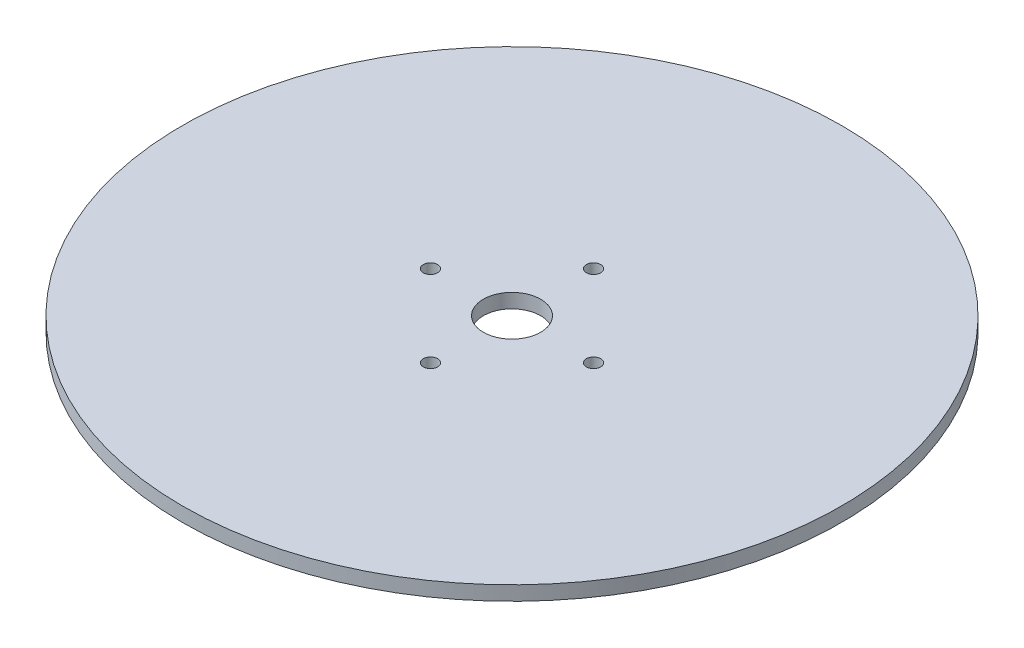
ISO-10303-21;
HEADER;
FILE_DESCRIPTION(('STEP AP214'),'2;1');
FILE_NAME('part.step','',(''),(''),'','','');
FILE_SCHEMA(('AUTOMOTIVE_DESIGN { 1 0 10303 214 1 1 1 1 }'));
ENDSEC;
DATA;
#1=APPLICATION_CONTEXT('core data for automotive mechanical design processes');
#2=APPLICATION_PROTOCOL_DEFINITION('international standard','automotive_design',2000,#1);
#3=PRODUCT_CONTEXT('',#1,'mechanical');
#4=PRODUCT('Part','Part','',(#3));
#5=PRODUCT_RELATED_PRODUCT_CATEGORY('part','',(#4));
#6=PRODUCT_DEFINITION_FORMATION('','',#4);
#7=PRODUCT_DEFINITION_CONTEXT('part definition',#1,'design');
#8=PRODUCT_DEFINITION('design','',#6,#7);
#9=PRODUCT_DEFINITION_SHAPE('','',#8);
#10=(LENGTH_UNIT() NAMED_UNIT(*) SI_UNIT(.MILLI.,.METRE.));
#11=(NAMED_UNIT(*) PLANE_ANGLE_UNIT() SI_UNIT($,.RADIAN.));
#12=(NAMED_UNIT(*) SI_UNIT($,.STERADIAN.) SOLID_ANGLE_UNIT());
#13=UNCERTAINTY_MEASURE_WITH_UNIT(LENGTH_MEASURE(1.E-05),#10,'distance_accuracy_value','');
#14=(GEOMETRIC_REPRESENTATION_CONTEXT(3) GLOBAL_UNCERTAINTY_ASSIGNED_CONTEXT((#13)) GLOBAL_UNIT_ASSIGNED_CONTEXT((#10,
#11,#12)) REPRESENTATION_CONTEXT('',''));
#15=CARTESIAN_POINT('',(0.,0.,0.));
#16=DIRECTION('',(0.,0.,1.));
#17=DIRECTION('',(1.,0.,0.));
#18=AXIS2_PLACEMENT_3D('',#15,#16,#17);
#19=CARTESIAN_POINT('',(0.,6.35,0.));
#20=DIRECTION('',(0.,1.,0.));
#21=DIRECTION('',(0.,0.,1.));
#22=AXIS2_PLACEMENT_3D('',#19,#20,#21);
#23=PLANE('',#22);
#24=CARTESIAN_POINT('',(2.04854579480274E-12,6.35,36.1315));
#25=DIRECTION('',(0.,1.,0.));
#26=DIRECTION('',(0.,0.,1.));
#27=AXIS2_PLACEMENT_3D('',#24,#25,#26);
#28=CIRCLE('',#27,3.1750000000022);
#29=CARTESIAN_POINT('',(2.04854579480274E-12,6.35,39.3065000000022));
#30=VERTEX_POINT('',#29);
#31=EDGE_CURVE('E58',#30,#30,#28,.T.);
#32=ORIENTED_EDGE('',*,*,#31,.F.);
#33=EDGE_LOOP('',(#32));
#34=FACE_BOUND('',#33,.T.);
#35=CARTESIAN_POINT('',(0.,6.35,-36.1315));
#36=DIRECTION('',(0.,1.,0.));
#37=DIRECTION('',(0.,0.,1.));
#38=AXIS2_PLACEMENT_3D('',#35,#36,#37);
#39=CIRCLE('',#38,3.175);
#40=CARTESIAN_POINT('',(0.,6.35,-32.9565));
#41=VERTEX_POINT('',#40);
#42=EDGE_CURVE('E46',#41,#41,#39,.T.);
#43=ORIENTED_EDGE('',*,*,#42,.F.);
#44=EDGE_LOOP('',(#43));
#45=FACE_BOUND('',#44,.T.);
#46=CARTESIAN_POINT('',(0.,6.35,0.));
#47=DIRECTION('',(0.,1.,0.));
#48=DIRECTION('',(0.,0.,1.));
#49=AXIS2_PLACEMENT_3D('',#46,#47,#48);
#50=CIRCLE('',#49,146.05);
#51=CARTESIAN_POINT('',(0.,6.35,146.05));
#52=VERTEX_POINT('',#51);
#53=EDGE_CURVE('E10',#52,#52,#50,.T.);
#54=ORIENTED_EDGE('',*,*,#53,.T.);
#55=EDGE_LOOP('',(#54));
#56=FACE_BOUND('',#55,.T.);
#57=CARTESIAN_POINT('',(0.,6.35,0.));
#58=DIRECTION('',(0.,1.,0.));
#59=DIRECTION('',(0.,0.,1.));
#60=AXIS2_PLACEMENT_3D('',#57,#58,#59);
#61=CIRCLE('',#60,12.7);
#62=CARTESIAN_POINT('',(0.,6.35,12.7));
#63=VERTEX_POINT('',#62);
#64=EDGE_CURVE('E41',#63,#63,#61,.T.);
#65=ORIENTED_EDGE('',*,*,#64,.F.);
#66=EDGE_LOOP('',(#65));
#67=FACE_BOUND('',#66,.T.);
#68=CARTESIAN_POINT('',(36.131500000001,6.35,-1.03113047614234E-12));
#69=DIRECTION('',(0.,1.,0.));
#70=DIRECTION('',(0.,0.,1.));
#71=AXIS2_PLACEMENT_3D('',#68,#69,#70);
#72=CIRCLE('',#71,3.1750000000022);
#73=CARTESIAN_POINT('',(36.131500000001,6.35,3.17500000000117));
#74=VERTEX_POINT('',#73);
#75=EDGE_CURVE('E52',#74,#74,#72,.T.);
#76=ORIENTED_EDGE('',*,*,#75,.F.);
#77=EDGE_LOOP('',(#76));
#78=FACE_BOUND('',#77,.T.);
#79=CARTESIAN_POINT('',(-36.131499999999,6.35,1.02169791724172E-12));
#80=DIRECTION('',(0.,1.,0.));
#81=DIRECTION('',(0.,0.,1.));
#82=AXIS2_PLACEMENT_3D('',#79,#80,#81);
#83=CIRCLE('',#82,3.1750000000022);
#84=CARTESIAN_POINT('',(-36.131499999999,6.35,3.17500000000323));
#85=VERTEX_POINT('',#84);
#86=EDGE_CURVE('E64',#85,#85,#83,.T.);
#87=ORIENTED_EDGE('',*,*,#86,.F.);
#88=EDGE_LOOP('',(#87));
#89=FACE_BOUND('',#88,.T.);
#90=ADVANCED_FACE('F30',(#34,#45,#56,#67,#78,#89),#23,.T.);
#91=CARTESIAN_POINT('',(0.,0.,0.));
#92=DIRECTION('',(0.,1.,0.));
#93=DIRECTION('',(0.,0.,1.));
#94=AXIS2_PLACEMENT_3D('',#91,#92,#93);
#95=PLANE('',#94);
#96=CARTESIAN_POINT('',(0.,0.,0.));
#97=DIRECTION('',(0.,1.,0.));
#98=DIRECTION('',(0.,0.,1.));
#99=AXIS2_PLACEMENT_3D('',#96,#97,#98);
#100=CIRCLE('',#99,146.05);
#101=CARTESIAN_POINT('',(0.,0.,146.05));
#102=VERTEX_POINT('',#101);
#103=EDGE_CURVE('E34',#102,#102,#100,.T.);
#104=ORIENTED_EDGE('',*,*,#103,.F.);
#105=EDGE_LOOP('',(#104));
#106=FACE_BOUND('',#105,.T.);
#107=CARTESIAN_POINT('',(0.,0.,0.));
#108=DIRECTION('',(0.,1.,0.));
#109=DIRECTION('',(0.,0.,1.));
#110=AXIS2_PLACEMENT_3D('',#107,#108,#109);
#111=CIRCLE('',#110,12.7);
#112=CARTESIAN_POINT('',(0.,0.,12.7));
#113=VERTEX_POINT('',#112);
#114=EDGE_CURVE('E43',#113,#113,#111,.T.);
#115=ORIENTED_EDGE('',*,*,#114,.T.);
#116=EDGE_LOOP('',(#115));
#117=FACE_BOUND('',#116,.T.);
#118=CARTESIAN_POINT('',(0.,0.,-36.1315));
#119=DIRECTION('',(0.,1.,0.));
#120=DIRECTION('',(0.,0.,1.));
#121=AXIS2_PLACEMENT_3D('',#118,#119,#120);
#122=CIRCLE('',#121,3.175);
#123=CARTESIAN_POINT('',(0.,0.,-32.9565));
#124=VERTEX_POINT('',#123);
#125=EDGE_CURVE('E49',#124,#124,#122,.T.);
#126=ORIENTED_EDGE('',*,*,#125,.T.);
#127=EDGE_LOOP('',(#126));
#128=FACE_BOUND('',#127,.T.);
#129=CARTESIAN_POINT('',(36.131500000001,0.,-1.03113047614234E-12));
#130=DIRECTION('',(0.,1.,0.));
#131=DIRECTION('',(0.,0.,1.));
#132=AXIS2_PLACEMENT_3D('',#129,#130,#131);
#133=CIRCLE('',#132,3.1750000000022);
#134=CARTESIAN_POINT('',(36.131500000001,0.,3.17500000000117));
#135=VERTEX_POINT('',#134);
#136=EDGE_CURVE('E55',#135,#135,#133,.T.);
#137=ORIENTED_EDGE('',*,*,#136,.T.);
#138=EDGE_LOOP('',(#137));
#139=FACE_BOUND('',#138,.T.);
#140=CARTESIAN_POINT('',(2.04854579480274E-12,0.,36.1315));
#141=DIRECTION('',(0.,1.,0.));
#142=DIRECTION('',(0.,0.,1.));
#143=AXIS2_PLACEMENT_3D('',#140,#141,#142);
#144=CIRCLE('',#143,3.1750000000022);
#145=CARTESIAN_POINT('',(2.04854579480274E-12,0.,39.3065000000022));
#146=VERTEX_POINT('',#145);
#147=EDGE_CURVE('E61',#146,#146,#144,.T.);
#148=ORIENTED_EDGE('',*,*,#147,.T.);
#149=EDGE_LOOP('',(#148));
#150=FACE_BOUND('',#149,.T.);
#151=CARTESIAN_POINT('',(-36.131499999999,0.,1.02169791724172E-12));
#152=DIRECTION('',(0.,1.,0.));
#153=DIRECTION('',(0.,0.,1.));
#154=AXIS2_PLACEMENT_3D('',#151,#152,#153);
#155=CIRCLE('',#154,3.1750000000022);
#156=CARTESIAN_POINT('',(-36.131499999999,0.,3.17500000000323));
#157=VERTEX_POINT('',#156);
#158=EDGE_CURVE('E67',#157,#157,#155,.T.);
#159=ORIENTED_EDGE('',*,*,#158,.T.);
#160=EDGE_LOOP('',(#159));
#161=FACE_BOUND('',#160,.T.);
#162=ADVANCED_FACE('F77',(#106,#117,#128,#139,#150,#161),#95,.F.);
#163=CARTESIAN_POINT('',(0.,6.35,0.));
#164=DIRECTION('',(0.,-1.,0.));
#165=DIRECTION('',(0.,0.,-1.));
#166=AXIS2_PLACEMENT_3D('',#163,#164,#165);
#167=CYLINDRICAL_SURFACE('',#166,146.05);
#168=ORIENTED_EDGE('',*,*,#53,.F.);
#169=EDGE_LOOP('',(#168));
#170=FACE_BOUND('',#169,.T.);
#171=ORIENTED_EDGE('',*,*,#103,.T.);
#172=EDGE_LOOP('',(#171));
#173=FACE_BOUND('',#172,.T.);
#174=ADVANCED_FACE('F32',(#170,#173),#167,.T.);
#175=CARTESIAN_POINT('',(0.,6.35,0.));
#176=DIRECTION('',(0.,-1.,0.));
#177=DIRECTION('',(0.,0.,-1.));
#178=AXIS2_PLACEMENT_3D('',#175,#176,#177);
#179=CYLINDRICAL_SURFACE('',#178,12.7);
#180=ORIENTED_EDGE('',*,*,#64,.T.);
#181=EDGE_LOOP('',(#180));
#182=FACE_BOUND('',#181,.T.);
#183=ORIENTED_EDGE('',*,*,#114,.F.);
#184=EDGE_LOOP('',(#183));
#185=FACE_BOUND('',#184,.T.);
#186=ADVANCED_FACE('F87',(#182,#185),#179,.F.);
#187=CARTESIAN_POINT('',(0.,6.35,-36.1315));
#188=DIRECTION('',(0.,-1.,0.));
#189=DIRECTION('',(0.,0.,-1.));
#190=AXIS2_PLACEMENT_3D('',#187,#188,#189);
#191=CYLINDRICAL_SURFACE('',#190,3.175);
#192=ORIENTED_EDGE('',*,*,#42,.T.);
#193=EDGE_LOOP('',(#192));
#194=FACE_BOUND('',#193,.T.);
#195=ORIENTED_EDGE('',*,*,#125,.F.);
#196=EDGE_LOOP('',(#195));
#197=FACE_BOUND('',#196,.T.);
#198=ADVANCED_FACE('F90',(#194,#197),#191,.F.);
#199=CARTESIAN_POINT('',(36.131500000001,6.35,-1.03113047614234E-12));
#200=DIRECTION('',(0.,-1.,0.));
#201=DIRECTION('',(0.,0.,-1.));
#202=AXIS2_PLACEMENT_3D('',#199,#200,#201);
#203=CYLINDRICAL_SURFACE('',#202,3.1750000000022);
#204=ORIENTED_EDGE('',*,*,#75,.T.);
#205=EDGE_LOOP('',(#204));
#206=FACE_BOUND('',#205,.T.);
#207=ORIENTED_EDGE('',*,*,#136,.F.);
#208=EDGE_LOOP('',(#207));
#209=FACE_BOUND('',#208,.T.);
#210=ADVANCED_FACE('F94',(#206,#209),#203,.F.);
#211=CARTESIAN_POINT('',(2.04854579480274E-12,6.35,36.1315));
#212=DIRECTION('',(0.,-1.,0.));
#213=DIRECTION('',(0.,0.,-1.));
#214=AXIS2_PLACEMENT_3D('',#211,#212,#213);
#215=CYLINDRICAL_SURFACE('',#214,3.1750000000022);
#216=ORIENTED_EDGE('',*,*,#31,.T.);
#217=EDGE_LOOP('',(#216));
#218=FACE_BOUND('',#217,.T.);
#219=ORIENTED_EDGE('',*,*,#147,.F.);
#220=EDGE_LOOP('',(#219));
#221=FACE_BOUND('',#220,.T.);
#222=ADVANCED_FACE('F98',(#218,#221),#215,.F.);
#223=CARTESIAN_POINT('',(-36.131499999999,6.35,1.02169791724172E-12));
#224=DIRECTION('',(0.,-1.,0.));
#225=DIRECTION('',(0.,0.,-1.));
#226=AXIS2_PLACEMENT_3D('',#223,#224,#225);
#227=CYLINDRICAL_SURFACE('',#226,3.1750000000022);
#228=ORIENTED_EDGE('',*,*,#86,.T.);
#229=EDGE_LOOP('',(#228));
#230=FACE_BOUND('',#229,.T.);
#231=ORIENTED_EDGE('',*,*,#158,.F.);
#232=EDGE_LOOP('',(#231));
#233=FACE_BOUND('',#232,.T.);
#234=ADVANCED_FACE('F73',(#230,#233),#227,.F.);
#235=CLOSED_SHELL('',(#90,#162,#174,#186,#198,#210,#222,#234));
#236=MANIFOLD_SOLID_BREP('B2',#235);
#237=ADVANCED_BREP_SHAPE_REPRESENTATION('',(#18,#236),#14);
#238=SHAPE_DEFINITION_REPRESENTATION(#9,#237);
ENDSEC;
END-ISO-10303-21;
